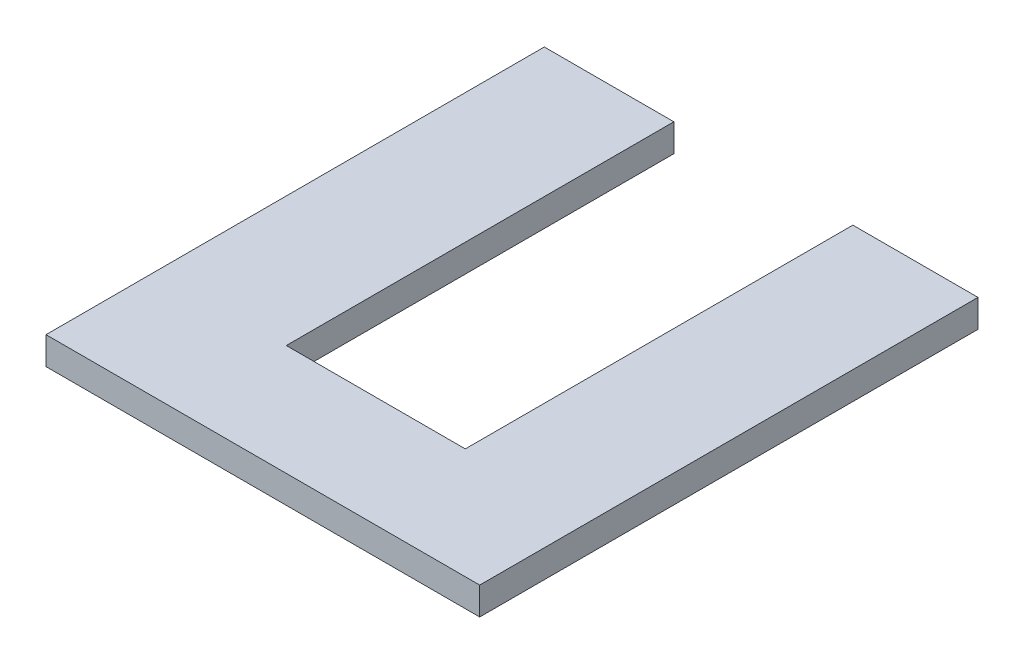
ISO-10303-21;
HEADER;
FILE_DESCRIPTION(('STEP AP214'),'2;1');
FILE_NAME('part.step','',(''),(''),'','','');
FILE_SCHEMA(('AUTOMOTIVE_DESIGN { 1 0 10303 214 1 1 1 1 }'));
ENDSEC;
DATA;
#1=APPLICATION_CONTEXT('core data for automotive mechanical design processes');
#2=APPLICATION_PROTOCOL_DEFINITION('international standard','automotive_design',2000,#1);
#3=PRODUCT_CONTEXT('',#1,'mechanical');
#4=PRODUCT('Part','Part','',(#3));
#5=PRODUCT_RELATED_PRODUCT_CATEGORY('part','',(#4));
#6=PRODUCT_DEFINITION_FORMATION('','',#4);
#7=PRODUCT_DEFINITION_CONTEXT('part definition',#1,'design');
#8=PRODUCT_DEFINITION('design','',#6,#7);
#9=PRODUCT_DEFINITION_SHAPE('','',#8);
#10=(LENGTH_UNIT() NAMED_UNIT(*) SI_UNIT(.MILLI.,.METRE.));
#11=(NAMED_UNIT(*) PLANE_ANGLE_UNIT() SI_UNIT($,.RADIAN.));
#12=(NAMED_UNIT(*) SI_UNIT($,.STERADIAN.) SOLID_ANGLE_UNIT());
#13=UNCERTAINTY_MEASURE_WITH_UNIT(LENGTH_MEASURE(1.E-05),#10,'distance_accuracy_value','');
#14=(GEOMETRIC_REPRESENTATION_CONTEXT(3) GLOBAL_UNCERTAINTY_ASSIGNED_CONTEXT((#13)) GLOBAL_UNIT_ASSIGNED_CONTEXT((#10,
#11,#12)) REPRESENTATION_CONTEXT('',''));
#15=CARTESIAN_POINT('',(0.,0.,0.));
#16=DIRECTION('',(0.,0.,1.));
#17=DIRECTION('',(1.,0.,0.));
#18=AXIS2_PLACEMENT_3D('',#15,#16,#17);
#19=CARTESIAN_POINT('',(0.,0.,0.));
#20=DIRECTION('',(0.,0.,-1.));
#21=DIRECTION('',(-1.,0.,0.));
#22=AXIS2_PLACEMENT_3D('',#19,#20,#21);
#23=PLANE('',#22);
#24=DIRECTION('',(0.,1.,0.));
#25=VECTOR('',#24,1.);
#26=CARTESIAN_POINT('',(702.,0.,0.));
#27=LINE('',#26,#25);
#28=CARTESIAN_POINT('',(702.,0.,0.));
#29=VERTEX_POINT('',#28);
#30=CARTESIAN_POINT('',(702.,150.,0.));
#31=VERTEX_POINT('',#30);
#32=EDGE_CURVE('E148',#29,#31,#27,.T.);
#33=ORIENTED_EDGE('',*,*,#32,.F.);
#34=DIRECTION('',(1.,0.,0.));
#35=VECTOR('',#34,1.);
#36=CARTESIAN_POINT('',(0.,0.,0.));
#37=LINE('',#36,#35);
#38=CARTESIAN_POINT('',(0.,0.,0.));
#39=VERTEX_POINT('',#38);
#40=EDGE_CURVE('E135',#39,#29,#37,.T.);
#41=ORIENTED_EDGE('',*,*,#40,.F.);
#42=DIRECTION('',(0.,-1.,0.));
#43=VECTOR('',#42,1.);
#44=CARTESIAN_POINT('',(0.,0.,0.));
#45=LINE('',#44,#43);
#46=CARTESIAN_POINT('',(0.,150.,0.));
#47=VERTEX_POINT('',#46);
#48=EDGE_CURVE('E151',#47,#39,#45,.T.);
#49=ORIENTED_EDGE('',*,*,#48,.F.);
#50=DIRECTION('',(-1.,0.,0.));
#51=VECTOR('',#50,1.);
#52=CARTESIAN_POINT('',(0.,150.,0.));
#53=LINE('',#52,#51);
#54=EDGE_CURVE('E84',#31,#47,#53,.T.);
#55=ORIENTED_EDGE('',*,*,#54,.F.);
#56=EDGE_LOOP('',(#33,#41,#49,#55));
#57=FACE_BOUND('',#56,.T.);
#58=ADVANCED_FACE('F38',(#57),#23,.T.);
#59=CARTESIAN_POINT('',(0.,0.,2700.));
#60=DIRECTION('',(1.,0.,0.));
#61=DIRECTION('',(0.,0.,-1.));
#62=AXIS2_PLACEMENT_3D('',#59,#60,#61);
#63=PLANE('',#62);
#64=ORIENTED_EDGE('',*,*,#48,.T.);
#65=DIRECTION('',(0.,0.,-1.));
#66=VECTOR('',#65,1.);
#67=CARTESIAN_POINT('',(0.,0.,2700.));
#68=LINE('',#67,#66);
#69=CARTESIAN_POINT('',(0.,0.,2700.));
#70=VERTEX_POINT('',#69);
#71=EDGE_CURVE('E11',#70,#39,#68,.T.);
#72=ORIENTED_EDGE('',*,*,#71,.F.);
#73=DIRECTION('',(0.,-1.,0.));
#74=VECTOR('',#73,1.);
#75=CARTESIAN_POINT('',(0.,0.,2700.));
#76=LINE('',#75,#74);
#77=CARTESIAN_POINT('',(0.,150.,2700.));
#78=VERTEX_POINT('',#77);
#79=EDGE_CURVE('E157',#78,#70,#76,.T.);
#80=ORIENTED_EDGE('',*,*,#79,.F.);
#81=DIRECTION('',(0.,0.,-1.));
#82=VECTOR('',#81,1.);
#83=CARTESIAN_POINT('',(0.,150.,2700.));
#84=LINE('',#83,#82);
#85=EDGE_CURVE('E168',#78,#47,#84,.T.);
#86=ORIENTED_EDGE('',*,*,#85,.T.);
#87=EDGE_LOOP('',(#64,#72,#80,#86));
#88=FACE_BOUND('',#87,.T.);
#89=ADVANCED_FACE('F40',(#88),#63,.F.);
#90=CARTESIAN_POINT('',(0.,0.,2700.));
#91=DIRECTION('',(0.,1.,0.));
#92=DIRECTION('',(0.,0.,1.));
#93=AXIS2_PLACEMENT_3D('',#90,#91,#92);
#94=PLANE('',#93);
#95=ORIENTED_EDGE('',*,*,#40,.T.);
#96=DIRECTION('',(0.,0.,1.));
#97=VECTOR('',#96,1.);
#98=CARTESIAN_POINT('',(702.,0.,0.));
#99=LINE('',#98,#97);
#100=CARTESIAN_POINT('',(702.,0.,2100.));
#101=VERTEX_POINT('',#100);
#102=EDGE_CURVE('E116',#29,#101,#99,.T.);
#103=ORIENTED_EDGE('',*,*,#102,.T.);
#104=DIRECTION('',(1.,0.,0.));
#105=VECTOR('',#104,1.);
#106=CARTESIAN_POINT('',(702.,0.,2100.));
#107=LINE('',#106,#105);
#108=CARTESIAN_POINT('',(1672.,0.,2100.));
#109=VERTEX_POINT('',#108);
#110=EDGE_CURVE('E127',#101,#109,#107,.T.);
#111=ORIENTED_EDGE('',*,*,#110,.T.);
#112=DIRECTION('',(0.,0.,-1.));
#113=VECTOR('',#112,1.);
#114=CARTESIAN_POINT('',(1672.,0.,0.));
#115=LINE('',#114,#113);
#116=CARTESIAN_POINT('',(1672.,0.,0.));
#117=VERTEX_POINT('',#116);
#118=EDGE_CURVE('E124',#109,#117,#115,.T.);
#119=ORIENTED_EDGE('',*,*,#118,.T.);
#120=CARTESIAN_POINT('',(2350.,0.,0.));
#121=VERTEX_POINT('',#120);
#122=EDGE_CURVE('E172',#117,#121,#37,.T.);
#123=ORIENTED_EDGE('',*,*,#122,.T.);
#124=DIRECTION('',(0.,0.,-1.));
#125=VECTOR('',#124,1.);
#126=CARTESIAN_POINT('',(2350.,0.,2700.));
#127=LINE('',#126,#125);
#128=CARTESIAN_POINT('',(2350.,0.,2700.));
#129=VERTEX_POINT('',#128);
#130=EDGE_CURVE('E47',#129,#121,#127,.T.);
#131=ORIENTED_EDGE('',*,*,#130,.F.);
#132=DIRECTION('',(1.,0.,0.));
#133=VECTOR('',#132,1.);
#134=CARTESIAN_POINT('',(0.,0.,2700.));
#135=LINE('',#134,#133);
#136=EDGE_CURVE('E91',#70,#129,#135,.T.);
#137=ORIENTED_EDGE('',*,*,#136,.F.);
#138=ORIENTED_EDGE('',*,*,#71,.T.);
#139=EDGE_LOOP('',(#95,#103,#111,#119,#123,#131,#137,#138));
#140=FACE_BOUND('',#139,.T.);
#141=ADVANCED_FACE('F134',(#140),#94,.F.);
#142=CARTESIAN_POINT('',(2350.,0.,2700.));
#143=DIRECTION('',(-1.,0.,0.));
#144=DIRECTION('',(0.,0.,1.));
#145=AXIS2_PLACEMENT_3D('',#142,#143,#144);
#146=PLANE('',#145);
#147=DIRECTION('',(0.,1.,0.));
#148=VECTOR('',#147,1.);
#149=CARTESIAN_POINT('',(2350.,0.,0.));
#150=LINE('',#149,#148);
#151=CARTESIAN_POINT('',(2350.,150.,0.));
#152=VERTEX_POINT('',#151);
#153=EDGE_CURVE('E175',#121,#152,#150,.T.);
#154=ORIENTED_EDGE('',*,*,#153,.T.);
#155=DIRECTION('',(0.,0.,-1.));
#156=VECTOR('',#155,1.);
#157=CARTESIAN_POINT('',(2350.,150.,2700.));
#158=LINE('',#157,#156);
#159=CARTESIAN_POINT('',(2350.,150.,2700.));
#160=VERTEX_POINT('',#159);
#161=EDGE_CURVE('E183',#160,#152,#158,.T.);
#162=ORIENTED_EDGE('',*,*,#161,.F.);
#163=DIRECTION('',(0.,1.,0.));
#164=VECTOR('',#163,1.);
#165=CARTESIAN_POINT('',(2350.,0.,2700.));
#166=LINE('',#165,#164);
#167=EDGE_CURVE('E163',#129,#160,#166,.T.);
#168=ORIENTED_EDGE('',*,*,#167,.F.);
#169=ORIENTED_EDGE('',*,*,#130,.T.);
#170=EDGE_LOOP('',(#154,#162,#168,#169));
#171=FACE_BOUND('',#170,.T.);
#172=ADVANCED_FACE('F191',(#171),#146,.F.);
#173=CARTESIAN_POINT('',(0.,150.,2700.));
#174=DIRECTION('',(0.,-1.,0.));
#175=DIRECTION('',(1.,0.,0.));
#176=AXIS2_PLACEMENT_3D('',#173,#174,#175);
#177=PLANE('',#176);
#178=DIRECTION('',(1.,0.,0.));
#179=VECTOR('',#178,1.);
#180=CARTESIAN_POINT('',(702.,150.,2100.));
#181=LINE('',#180,#179);
#182=CARTESIAN_POINT('',(702.,150.,2100.));
#183=VERTEX_POINT('',#182);
#184=CARTESIAN_POINT('',(1672.,150.,2100.));
#185=VERTEX_POINT('',#184);
#186=EDGE_CURVE('E139',#183,#185,#181,.T.);
#187=ORIENTED_EDGE('',*,*,#186,.F.);
#188=DIRECTION('',(0.,0.,1.));
#189=VECTOR('',#188,1.);
#190=CARTESIAN_POINT('',(702.,150.,0.));
#191=LINE('',#190,#189);
#192=EDGE_CURVE('E118',#31,#183,#191,.T.);
#193=ORIENTED_EDGE('',*,*,#192,.F.);
#194=ORIENTED_EDGE('',*,*,#54,.T.);
#195=ORIENTED_EDGE('',*,*,#85,.F.);
#196=DIRECTION('',(-1.,0.,0.));
#197=VECTOR('',#196,1.);
#198=CARTESIAN_POINT('',(0.,150.,2700.));
#199=LINE('',#198,#197);
#200=EDGE_CURVE('E63',#160,#78,#199,.T.);
#201=ORIENTED_EDGE('',*,*,#200,.F.);
#202=ORIENTED_EDGE('',*,*,#161,.T.);
#203=CARTESIAN_POINT('',(1672.,150.,0.));
#204=VERTEX_POINT('',#203);
#205=EDGE_CURVE('E160',#152,#204,#53,.T.);
#206=ORIENTED_EDGE('',*,*,#205,.T.);
#207=DIRECTION('',(0.,0.,-1.));
#208=VECTOR('',#207,1.);
#209=CARTESIAN_POINT('',(1672.,150.,0.));
#210=LINE('',#209,#208);
#211=EDGE_CURVE('E54',#185,#204,#210,.T.);
#212=ORIENTED_EDGE('',*,*,#211,.F.);
#213=EDGE_LOOP('',(#187,#193,#194,#195,#201,#202,#206,#212));
#214=FACE_BOUND('',#213,.T.);
#215=ADVANCED_FACE('F197',(#214),#177,.F.);
#216=CARTESIAN_POINT('',(0.,0.,2700.));
#217=DIRECTION('',(0.,0.,-1.));
#218=DIRECTION('',(-1.,0.,0.));
#219=AXIS2_PLACEMENT_3D('',#216,#217,#218);
#220=PLANE('',#219);
#221=ORIENTED_EDGE('',*,*,#79,.T.);
#222=ORIENTED_EDGE('',*,*,#136,.T.);
#223=ORIENTED_EDGE('',*,*,#167,.T.);
#224=ORIENTED_EDGE('',*,*,#200,.T.);
#225=EDGE_LOOP('',(#221,#222,#223,#224));
#226=FACE_BOUND('',#225,.T.);
#227=ADVANCED_FACE('F202',(#226),#220,.F.);
#228=DIRECTION('',(0.,1.,0.));
#229=VECTOR('',#228,1.);
#230=CARTESIAN_POINT('',(1672.,0.,0.));
#231=LINE('',#230,#229);
#232=EDGE_CURVE('E152',#117,#204,#231,.T.);
#233=ORIENTED_EDGE('',*,*,#232,.T.);
#234=ORIENTED_EDGE('',*,*,#205,.F.);
#235=ORIENTED_EDGE('',*,*,#153,.F.);
#236=ORIENTED_EDGE('',*,*,#122,.F.);
#237=EDGE_LOOP('',(#233,#234,#235,#236));
#238=FACE_BOUND('',#237,.T.);
#239=ADVANCED_FACE('F196',(#238),#23,.T.);
#240=CARTESIAN_POINT('',(702.,0.,0.));
#241=DIRECTION('',(-1.,0.,0.));
#242=DIRECTION('',(0.,0.,1.));
#243=AXIS2_PLACEMENT_3D('',#240,#241,#242);
#244=PLANE('',#243);
#245=ORIENTED_EDGE('',*,*,#192,.T.);
#246=DIRECTION('',(0.,1.,0.));
#247=VECTOR('',#246,1.);
#248=CARTESIAN_POINT('',(702.,0.,2100.));
#249=LINE('',#248,#247);
#250=EDGE_CURVE('E112',#101,#183,#249,.T.);
#251=ORIENTED_EDGE('',*,*,#250,.F.);
#252=ORIENTED_EDGE('',*,*,#102,.F.);
#253=ORIENTED_EDGE('',*,*,#32,.T.);
#254=EDGE_LOOP('',(#245,#251,#252,#253));
#255=FACE_BOUND('',#254,.T.);
#256=ADVANCED_FACE('F114',(#255),#244,.F.);
#257=CARTESIAN_POINT('',(1672.,0.,0.));
#258=DIRECTION('',(1.,0.,0.));
#259=DIRECTION('',(0.,0.,-1.));
#260=AXIS2_PLACEMENT_3D('',#257,#258,#259);
#261=PLANE('',#260);
#262=ORIENTED_EDGE('',*,*,#211,.T.);
#263=ORIENTED_EDGE('',*,*,#232,.F.);
#264=ORIENTED_EDGE('',*,*,#118,.F.);
#265=DIRECTION('',(0.,1.,0.));
#266=VECTOR('',#265,1.);
#267=CARTESIAN_POINT('',(1672.,0.,2100.));
#268=LINE('',#267,#266);
#269=EDGE_CURVE('E123',#109,#185,#268,.T.);
#270=ORIENTED_EDGE('',*,*,#269,.T.);
#271=EDGE_LOOP('',(#262,#263,#264,#270));
#272=FACE_BOUND('',#271,.T.);
#273=ADVANCED_FACE('F238',(#272),#261,.F.);
#274=CARTESIAN_POINT('',(702.,0.,2100.));
#275=DIRECTION('',(0.,0.,1.));
#276=DIRECTION('',(1.,0.,0.));
#277=AXIS2_PLACEMENT_3D('',#274,#275,#276);
#278=PLANE('',#277);
#279=ORIENTED_EDGE('',*,*,#186,.T.);
#280=ORIENTED_EDGE('',*,*,#269,.F.);
#281=ORIENTED_EDGE('',*,*,#110,.F.);
#282=ORIENTED_EDGE('',*,*,#250,.T.);
#283=EDGE_LOOP('',(#279,#280,#281,#282));
#284=FACE_BOUND('',#283,.T.);
#285=ADVANCED_FACE('F128',(#284),#278,.F.);
#286=CLOSED_SHELL('',(#58,#89,#141,#172,#215,#227,#239,#256,#273,#285));
#287=MANIFOLD_SOLID_BREP('B2',#286);
#288=ADVANCED_BREP_SHAPE_REPRESENTATION('',(#18,#287),#14);
#289=SHAPE_DEFINITION_REPRESENTATION(#9,#288);
ENDSEC;
END-ISO-10303-21;
